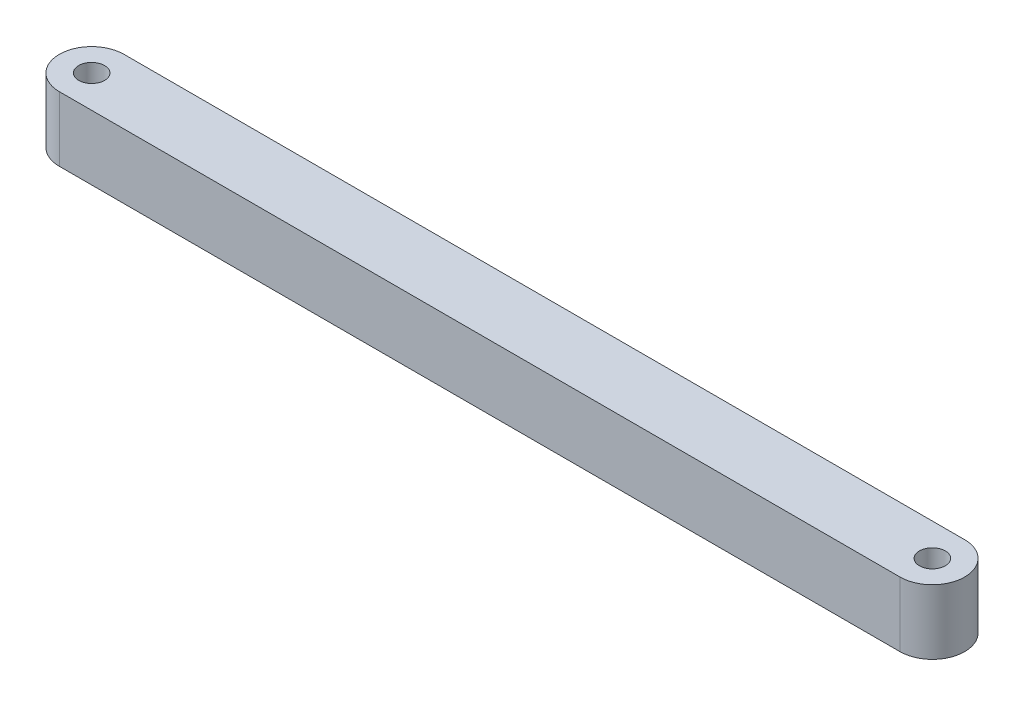
ISO-10303-21;
HEADER;
FILE_DESCRIPTION(('STEP AP214'),'2;1');
FILE_NAME('part.step','',(''),(''),'','','');
FILE_SCHEMA(('AUTOMOTIVE_DESIGN { 1 0 10303 214 1 1 1 1 }'));
ENDSEC;
DATA;
#1=APPLICATION_CONTEXT('core data for automotive mechanical design processes');
#2=APPLICATION_PROTOCOL_DEFINITION('international standard','automotive_design',2000,#1);
#3=PRODUCT_CONTEXT('',#1,'mechanical');
#4=PRODUCT('Part','Part','',(#3));
#5=PRODUCT_RELATED_PRODUCT_CATEGORY('part','',(#4));
#6=PRODUCT_DEFINITION_FORMATION('','',#4);
#7=PRODUCT_DEFINITION_CONTEXT('part definition',#1,'design');
#8=PRODUCT_DEFINITION('design','',#6,#7);
#9=PRODUCT_DEFINITION_SHAPE('','',#8);
#10=(LENGTH_UNIT() NAMED_UNIT(*) SI_UNIT(.MILLI.,.METRE.));
#11=(NAMED_UNIT(*) PLANE_ANGLE_UNIT() SI_UNIT($,.RADIAN.));
#12=(NAMED_UNIT(*) SI_UNIT($,.STERADIAN.) SOLID_ANGLE_UNIT());
#13=UNCERTAINTY_MEASURE_WITH_UNIT(LENGTH_MEASURE(1.E-05),#10,'distance_accuracy_value','');
#14=(GEOMETRIC_REPRESENTATION_CONTEXT(3) GLOBAL_UNCERTAINTY_ASSIGNED_CONTEXT((#13)) GLOBAL_UNIT_ASSIGNED_CONTEXT((#10,
#11,#12)) REPRESENTATION_CONTEXT('',''));
#15=CARTESIAN_POINT('',(0.,0.,0.));
#16=DIRECTION('',(0.,0.,1.));
#17=DIRECTION('',(1.,0.,0.));
#18=AXIS2_PLACEMENT_3D('',#15,#16,#17);
#19=CARTESIAN_POINT('',(0.,5.,0.));
#20=DIRECTION('',(0.,-1.,0.));
#21=DIRECTION('',(0.,0.,-1.));
#22=AXIS2_PLACEMENT_3D('',#19,#20,#21);
#23=CYLINDRICAL_SURFACE('',#22,2.5);
#24=CARTESIAN_POINT('',(0.,0.,0.));
#25=DIRECTION('',(0.,1.,0.));
#26=DIRECTION('',(0.,0.,1.));
#27=AXIS2_PLACEMENT_3D('',#24,#25,#26);
#28=CIRCLE('',#27,2.5);
#29=CARTESIAN_POINT('',(0.,0.,2.5));
#30=VERTEX_POINT('',#29);
#31=CARTESIAN_POINT('',(0.,0.,-2.5));
#32=VERTEX_POINT('',#31);
#33=EDGE_CURVE('E95',#30,#32,#28,.T.);
#34=ORIENTED_EDGE('',*,*,#33,.T.);
#35=DIRECTION('',(0.,-1.,0.));
#36=VECTOR('',#35,1.);
#37=CARTESIAN_POINT('',(0.,5.,-2.5));
#38=LINE('',#37,#36);
#39=CARTESIAN_POINT('',(0.,5.,-2.5));
#40=VERTEX_POINT('',#39);
#41=EDGE_CURVE('E11',#40,#32,#38,.T.);
#42=ORIENTED_EDGE('',*,*,#41,.F.);
#43=CARTESIAN_POINT('',(0.,5.,0.));
#44=DIRECTION('',(0.,1.,0.));
#45=DIRECTION('',(0.,0.,1.));
#46=AXIS2_PLACEMENT_3D('',#43,#44,#45);
#47=CIRCLE('',#46,2.5);
#48=CARTESIAN_POINT('',(0.,5.,2.5));
#49=VERTEX_POINT('',#48);
#50=EDGE_CURVE('E83',#49,#40,#47,.T.);
#51=ORIENTED_EDGE('',*,*,#50,.F.);
#52=DIRECTION('',(0.,-1.,0.));
#53=VECTOR('',#52,1.);
#54=CARTESIAN_POINT('',(0.,5.,2.5));
#55=LINE('',#54,#53);
#56=EDGE_CURVE('E91',#49,#30,#55,.T.);
#57=ORIENTED_EDGE('',*,*,#56,.T.);
#58=EDGE_LOOP('',(#34,#42,#51,#57));
#59=FACE_BOUND('',#58,.T.);
#60=ADVANCED_FACE('F32',(#59),#23,.T.);
#61=CARTESIAN_POINT('',(0.,5.,-2.5));
#62=DIRECTION('',(0.,0.,1.));
#63=DIRECTION('',(1.,0.,0.));
#64=AXIS2_PLACEMENT_3D('',#61,#62,#63);
#65=PLANE('',#64);
#66=DIRECTION('',(-1.,0.,0.));
#67=VECTOR('',#66,1.);
#68=CARTESIAN_POINT('',(0.,0.,-2.5));
#69=LINE('',#68,#67);
#70=CARTESIAN_POINT('',(-65.,0.,-2.5));
#71=VERTEX_POINT('',#70);
#72=EDGE_CURVE('E87',#32,#71,#69,.T.);
#73=ORIENTED_EDGE('',*,*,#72,.T.);
#74=DIRECTION('',(0.,-1.,0.));
#75=VECTOR('',#74,1.);
#76=CARTESIAN_POINT('',(-65.,5.,-2.5));
#77=LINE('',#76,#75);
#78=CARTESIAN_POINT('',(-65.,5.,-2.5));
#79=VERTEX_POINT('',#78);
#80=EDGE_CURVE('E40',#79,#71,#77,.T.);
#81=ORIENTED_EDGE('',*,*,#80,.F.);
#82=DIRECTION('',(-1.,0.,0.));
#83=VECTOR('',#82,1.);
#84=CARTESIAN_POINT('',(0.,5.,-2.5));
#85=LINE('',#84,#83);
#86=EDGE_CURVE('E78',#40,#79,#85,.T.);
#87=ORIENTED_EDGE('',*,*,#86,.F.);
#88=ORIENTED_EDGE('',*,*,#41,.T.);
#89=EDGE_LOOP('',(#73,#81,#87,#88));
#90=FACE_BOUND('',#89,.T.);
#91=ADVANCED_FACE('F86',(#90),#65,.F.);
#92=CARTESIAN_POINT('',(-65.,5.,0.));
#93=DIRECTION('',(0.,-1.,0.));
#94=DIRECTION('',(0.,0.,-1.));
#95=AXIS2_PLACEMENT_3D('',#92,#93,#94);
#96=CYLINDRICAL_SURFACE('',#95,2.5);
#97=CARTESIAN_POINT('',(-65.,0.,0.));
#98=DIRECTION('',(0.,1.,0.));
#99=DIRECTION('',(0.,0.,1.));
#100=AXIS2_PLACEMENT_3D('',#97,#98,#99);
#101=CIRCLE('',#100,2.5);
#102=CARTESIAN_POINT('',(-65.,0.,2.50000000000001));
#103=VERTEX_POINT('',#102);
#104=EDGE_CURVE('E65',#71,#103,#101,.T.);
#105=ORIENTED_EDGE('',*,*,#104,.T.);
#106=DIRECTION('',(0.,-1.,0.));
#107=VECTOR('',#106,1.);
#108=CARTESIAN_POINT('',(-65.,5.,2.50000000000001));
#109=LINE('',#108,#107);
#110=CARTESIAN_POINT('',(-65.,5.,2.50000000000001));
#111=VERTEX_POINT('',#110);
#112=EDGE_CURVE('E88',#111,#103,#109,.T.);
#113=ORIENTED_EDGE('',*,*,#112,.F.);
#114=CARTESIAN_POINT('',(-65.,5.,0.));
#115=DIRECTION('',(0.,1.,0.));
#116=DIRECTION('',(0.,0.,1.));
#117=AXIS2_PLACEMENT_3D('',#114,#115,#116);
#118=CIRCLE('',#117,2.5);
#119=EDGE_CURVE('E81',#79,#111,#118,.T.);
#120=ORIENTED_EDGE('',*,*,#119,.F.);
#121=ORIENTED_EDGE('',*,*,#80,.T.);
#122=EDGE_LOOP('',(#105,#113,#120,#121));
#123=FACE_BOUND('',#122,.T.);
#124=ADVANCED_FACE('F89',(#123),#96,.T.);
#125=CARTESIAN_POINT('',(0.,5.,2.5));
#126=DIRECTION('',(0.,0.,-1.));
#127=DIRECTION('',(-1.,0.,0.));
#128=AXIS2_PLACEMENT_3D('',#125,#126,#127);
#129=PLANE('',#128);
#130=DIRECTION('',(1.,0.,0.));
#131=VECTOR('',#130,1.);
#132=CARTESIAN_POINT('',(0.,0.,2.5));
#133=LINE('',#132,#131);
#134=EDGE_CURVE('E71',#103,#30,#133,.T.);
#135=ORIENTED_EDGE('',*,*,#134,.T.);
#136=ORIENTED_EDGE('',*,*,#56,.F.);
#137=DIRECTION('',(1.,0.,0.));
#138=VECTOR('',#137,1.);
#139=CARTESIAN_POINT('',(0.,5.,2.5));
#140=LINE('',#139,#138);
#141=EDGE_CURVE('E48',#111,#49,#140,.T.);
#142=ORIENTED_EDGE('',*,*,#141,.F.);
#143=ORIENTED_EDGE('',*,*,#112,.T.);
#144=EDGE_LOOP('',(#135,#136,#142,#143));
#145=FACE_BOUND('',#144,.T.);
#146=ADVANCED_FACE('F103',(#145),#129,.F.);
#147=CARTESIAN_POINT('',(0.,5.,0.));
#148=DIRECTION('',(0.,1.,0.));
#149=DIRECTION('',(0.,0.,1.));
#150=AXIS2_PLACEMENT_3D('',#147,#148,#149);
#151=PLANE('',#150);
#152=CARTESIAN_POINT('',(0.,5.,0.));
#153=DIRECTION('',(0.,1.,0.));
#154=DIRECTION('',(0.,0.,1.));
#155=AXIS2_PLACEMENT_3D('',#152,#153,#154);
#156=CIRCLE('',#155,1.);
#157=CARTESIAN_POINT('',(0.,5.,1.));
#158=VERTEX_POINT('',#157);
#159=EDGE_CURVE('E117',#158,#158,#156,.T.);
#160=ORIENTED_EDGE('',*,*,#159,.F.);
#161=EDGE_LOOP('',(#160));
#162=FACE_BOUND('',#161,.T.);
#163=CARTESIAN_POINT('',(-65.,5.,0.));
#164=DIRECTION('',(0.,1.,0.));
#165=DIRECTION('',(0.,0.,1.));
#166=AXIS2_PLACEMENT_3D('',#163,#164,#165);
#167=CIRCLE('',#166,0.999999999999998);
#168=CARTESIAN_POINT('',(-65.,5.,0.999999999999998));
#169=VERTEX_POINT('',#168);
#170=EDGE_CURVE('E111',#169,#169,#167,.T.);
#171=ORIENTED_EDGE('',*,*,#170,.F.);
#172=EDGE_LOOP('',(#171));
#173=FACE_BOUND('',#172,.T.);
#174=ORIENTED_EDGE('',*,*,#50,.T.);
#175=ORIENTED_EDGE('',*,*,#86,.T.);
#176=ORIENTED_EDGE('',*,*,#119,.T.);
#177=ORIENTED_EDGE('',*,*,#141,.T.);
#178=EDGE_LOOP('',(#174,#175,#176,#177));
#179=FACE_BOUND('',#178,.T.);
#180=ADVANCED_FACE('F79',(#162,#173,#179),#151,.T.);
#181=CARTESIAN_POINT('',(0.,0.,0.));
#182=DIRECTION('',(0.,1.,0.));
#183=DIRECTION('',(0.,0.,1.));
#184=AXIS2_PLACEMENT_3D('',#181,#182,#183);
#185=PLANE('',#184);
#186=CARTESIAN_POINT('',(0.,0.,0.));
#187=DIRECTION('',(0.,1.,0.));
#188=DIRECTION('',(0.,0.,1.));
#189=AXIS2_PLACEMENT_3D('',#186,#187,#188);
#190=CIRCLE('',#189,1.);
#191=CARTESIAN_POINT('',(0.,0.,1.));
#192=VERTEX_POINT('',#191);
#193=EDGE_CURVE('E114',#192,#192,#190,.F.);
#194=ORIENTED_EDGE('',*,*,#193,.F.);
#195=EDGE_LOOP('',(#194));
#196=FACE_BOUND('',#195,.T.);
#197=CARTESIAN_POINT('',(-65.,0.,0.));
#198=DIRECTION('',(0.,1.,0.));
#199=DIRECTION('',(0.,0.,1.));
#200=AXIS2_PLACEMENT_3D('',#197,#198,#199);
#201=CIRCLE('',#200,0.999999999999998);
#202=CARTESIAN_POINT('',(-65.,0.,0.999999999999998));
#203=VERTEX_POINT('',#202);
#204=EDGE_CURVE('E98',#203,#203,#201,.F.);
#205=ORIENTED_EDGE('',*,*,#204,.F.);
#206=EDGE_LOOP('',(#205));
#207=FACE_BOUND('',#206,.T.);
#208=ORIENTED_EDGE('',*,*,#33,.F.);
#209=ORIENTED_EDGE('',*,*,#134,.F.);
#210=ORIENTED_EDGE('',*,*,#104,.F.);
#211=ORIENTED_EDGE('',*,*,#72,.F.);
#212=EDGE_LOOP('',(#208,#209,#210,#211));
#213=FACE_BOUND('',#212,.T.);
#214=ADVANCED_FACE('F106',(#196,#207,#213),#185,.F.);
#215=CARTESIAN_POINT('',(-65.,-0.00100000000000013,0.));
#216=DIRECTION('',(0.,1.,0.));
#217=DIRECTION('',(0.,0.,1.));
#218=AXIS2_PLACEMENT_3D('',#215,#216,#217);
#219=CYLINDRICAL_SURFACE('',#218,0.999999999999998);
#220=ORIENTED_EDGE('',*,*,#170,.T.);
#221=EDGE_LOOP('',(#220));
#222=FACE_BOUND('',#221,.T.);
#223=ORIENTED_EDGE('',*,*,#204,.T.);
#224=EDGE_LOOP('',(#223));
#225=FACE_BOUND('',#224,.T.);
#226=ADVANCED_FACE('F129',(#222,#225),#219,.F.);
#227=CARTESIAN_POINT('',(0.,-0.00100000000000013,0.));
#228=DIRECTION('',(0.,1.,0.));
#229=DIRECTION('',(0.,0.,1.));
#230=AXIS2_PLACEMENT_3D('',#227,#228,#229);
#231=CYLINDRICAL_SURFACE('',#230,1.);
#232=ORIENTED_EDGE('',*,*,#159,.T.);
#233=EDGE_LOOP('',(#232));
#234=FACE_BOUND('',#233,.T.);
#235=ORIENTED_EDGE('',*,*,#193,.T.);
#236=EDGE_LOOP('',(#235));
#237=FACE_BOUND('',#236,.T.);
#238=ADVANCED_FACE('F121',(#234,#237),#231,.F.);
#239=CLOSED_SHELL('',(#60,#91,#124,#146,#180,#214,#226,#238));
#240=MANIFOLD_SOLID_BREP('B2',#239);
#241=ADVANCED_BREP_SHAPE_REPRESENTATION('',(#18,#240),#14);
#242=SHAPE_DEFINITION_REPRESENTATION(#9,#241);
ENDSEC;
END-ISO-10303-21;
